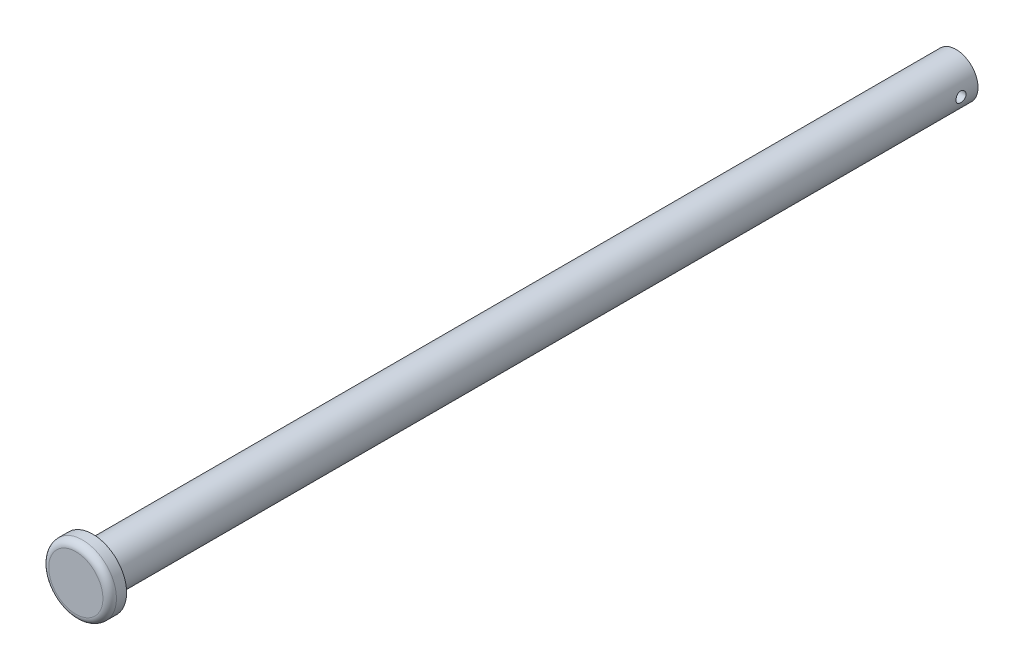
ISO-10303-21;
HEADER;
FILE_DESCRIPTION(('STEP AP214'),'2;1');
FILE_NAME('part.step','',(''),(''),'','','');
FILE_SCHEMA(('AUTOMOTIVE_DESIGN { 1 0 10303 214 1 1 1 1 }'));
ENDSEC;
DATA;
#1=APPLICATION_CONTEXT('core data for automotive mechanical design processes');
#2=APPLICATION_PROTOCOL_DEFINITION('international standard','automotive_design',2000,#1);
#3=PRODUCT_CONTEXT('',#1,'mechanical');
#4=PRODUCT('Part','Part','',(#3));
#5=PRODUCT_RELATED_PRODUCT_CATEGORY('part','',(#4));
#6=PRODUCT_DEFINITION_FORMATION('','',#4);
#7=PRODUCT_DEFINITION_CONTEXT('part definition',#1,'design');
#8=PRODUCT_DEFINITION('design','',#6,#7);
#9=PRODUCT_DEFINITION_SHAPE('','',#8);
#10=(LENGTH_UNIT() NAMED_UNIT(*) SI_UNIT(.MILLI.,.METRE.));
#11=(NAMED_UNIT(*) PLANE_ANGLE_UNIT() SI_UNIT($,.RADIAN.));
#12=(NAMED_UNIT(*) SI_UNIT($,.STERADIAN.) SOLID_ANGLE_UNIT());
#13=UNCERTAINTY_MEASURE_WITH_UNIT(LENGTH_MEASURE(1.E-05),#10,'distance_accuracy_value','');
#14=(GEOMETRIC_REPRESENTATION_CONTEXT(3) GLOBAL_UNCERTAINTY_ASSIGNED_CONTEXT((#13)) GLOBAL_UNIT_ASSIGNED_CONTEXT((#10,
#11,#12)) REPRESENTATION_CONTEXT('',''));
#15=CARTESIAN_POINT('',(0.,0.,0.));
#16=DIRECTION('',(0.,0.,1.));
#17=DIRECTION('',(1.,0.,0.));
#18=AXIS2_PLACEMENT_3D('',#15,#16,#17);
#19=CARTESIAN_POINT('',(0.,0.,255.));
#20=DIRECTION('',(0.,0.,-1.));
#21=DIRECTION('',(-1.,0.,0.));
#22=AXIS2_PLACEMENT_3D('',#19,#20,#21);
#23=CYLINDRICAL_SURFACE('',#22,6.5);
#24=CARTESIAN_POINT('',(-6.5,0.,6.50000000000001));
#25=CARTESIAN_POINT('',(-6.49999849532867,-0.0830761724763329,6.49999733464412));
#26=CARTESIAN_POINT('',(-6.49839124214547,-0.166183602986824,6.49307507318891));
#27=CARTESIAN_POINT('',(-6.49213500375529,-0.330029933246622,6.46560235711436));
#28=CARTESIAN_POINT('',(-6.48748401185165,-0.410767233683357,6.44504291155861));
#29=CARTESIAN_POINT('',(-6.4756571064677,-0.56748240064943,6.39098030105908));
#30=CARTESIAN_POINT('',(-6.46848397910972,-0.643465410431946,6.35749141486866));
#31=CARTESIAN_POINT('',(-6.45238316831829,-0.788732955280496,6.27856773493165));
#32=CARTESIAN_POINT('',(-6.44345549077589,-0.858017512835941,6.23313298129409));
#33=CARTESIAN_POINT('',(-6.42464323305021,-0.989152353123209,6.13075474832278));
#34=CARTESIAN_POINT('',(-6.41474568654138,-1.0508667921612,6.07363963829751));
#35=CARTESIAN_POINT('',(-6.39519859507266,-1.16393060397694,5.94989007342869));
#36=CARTESIAN_POINT('',(-6.38554907436474,-1.2152789664991,5.88325469183955));
#37=CARTESIAN_POINT('',(-6.36746174180576,-1.3067669575256,5.74133307243969));
#38=CARTESIAN_POINT('',(-6.35904049089481,-1.34675925477788,5.66594955902319));
#39=CARTESIAN_POINT('',(-6.34455046029963,-1.41345395330061,5.50930490134943));
#40=CARTESIAN_POINT('',(-6.33848136485541,-1.44015813854149,5.42804454775489));
#41=CARTESIAN_POINT('',(-6.32951534623235,-1.4790642425856,5.2634341984173));
#42=CARTESIAN_POINT('',(-6.32656557105072,-1.4915080949688,5.18014432662519));
#43=CARTESIAN_POINT('',(-6.32401364937952,-1.50229307046533,5.01261091295435));
#44=CARTESIAN_POINT('',(-6.32441104286172,-1.50063613156308,4.92836750371723));
#45=CARTESIAN_POINT('',(-6.32846083321138,-1.48346063285703,4.76313719217618));
#46=CARTESIAN_POINT('',(-6.33204661249556,-1.46822575315178,4.68211891865604));
#47=CARTESIAN_POINT('',(-6.34196351386389,-1.42477741479347,4.52382020809836));
#48=CARTESIAN_POINT('',(-6.34829480548987,-1.39656315462671,4.4465400022229));
#49=CARTESIAN_POINT('',(-6.36305332227188,-1.32770349075046,4.29712732835905));
#50=CARTESIAN_POINT('',(-6.37149843240945,-1.28695129246527,4.22504591908902));
#51=CARTESIAN_POINT('',(-6.38952239681953,-1.19424748975255,4.08864076371063));
#52=CARTESIAN_POINT('',(-6.39910142196225,-1.1422941964553,4.02431818974098));
#53=CARTESIAN_POINT('',(-6.41859777640792,-1.02717321086452,3.90362604994904));
#54=CARTESIAN_POINT('',(-6.42851768847713,-0.963764950845046,3.84748611487504));
#55=CARTESIAN_POINT('',(-6.44736816069401,-0.8283186410534,3.74659692902463));
#56=CARTESIAN_POINT('',(-6.45629869876004,-0.75628039874503,3.70184793245139));
#57=CARTESIAN_POINT('',(-6.47219854082993,-0.60532127797237,3.62494408585666));
#58=CARTESIAN_POINT('',(-6.47916273202417,-0.526383143294241,3.59282198430733));
#59=CARTESIAN_POINT('',(-6.49030757986402,-0.364032396252573,3.54236385630495));
#60=CARTESIAN_POINT('',(-6.49448868821629,-0.280620512374232,3.52402559261152));
#61=CARTESIAN_POINT('',(-6.49953102945198,-0.113657323931638,3.50199584965185));
#62=CARTESIAN_POINT('',(-6.50046326526885,-0.0301494450127247,3.49799106394026));
#63=CARTESIAN_POINT('',(-6.49910299913129,0.136342371579228,3.50388901475929));
#64=CARTESIAN_POINT('',(-6.49681074208306,0.219326348562747,3.51379069506801));
#65=CARTESIAN_POINT('',(-6.48930412349636,0.381357903798026,3.54696119660578));
#66=CARTESIAN_POINT('',(-6.48412623941868,0.460441464875706,3.57006324131715));
#67=CARTESIAN_POINT('',(-6.47142910428788,0.613609622481669,3.62879158892438));
#68=CARTESIAN_POINT('',(-6.46390963894221,0.687693760726586,3.66441903813586));
#69=CARTESIAN_POINT('',(-6.44718996088191,0.830037615110187,3.747822643921));
#70=CARTESIAN_POINT('',(-6.43796535296184,0.898188410296332,3.79577969188521));
#71=CARTESIAN_POINT('',(-6.41890391913981,1.02558718048179,3.90224561735857));
#72=CARTESIAN_POINT('',(-6.40906700421673,1.08483385664763,3.96075603154158));
#73=CARTESIAN_POINT('',(-6.38964047483402,1.19400102833017,4.08811238587905));
#74=CARTESIAN_POINT('',(-6.3800601750374,1.24370343589041,4.15714696467741));
#75=CARTESIAN_POINT('',(-6.36246188496285,1.3308123544641,4.30276588021528));
#76=CARTESIAN_POINT('',(-6.35444382521927,1.36821941224621,4.37934988103844));
#77=CARTESIAN_POINT('',(-6.34095951164845,1.4294106686813,4.53747598842251));
#78=CARTESIAN_POINT('',(-6.33547846174879,1.45327404481082,4.61898612968342));
#79=CARTESIAN_POINT('',(-6.3276660054956,1.48692530676326,4.78500399284776));
#80=CARTESIAN_POINT('',(-6.32533402889436,1.49671574099563,4.86951116919002));
#81=CARTESIAN_POINT('',(-6.32412253425542,1.50182536015786,5.03691822705261));
#82=CARTESIAN_POINT('',(-6.32516029248235,1.49749127871472,5.11980711064855));
#83=CARTESIAN_POINT('',(-6.33038270361014,1.47525685980881,5.28363867866817));
#84=CARTESIAN_POINT('',(-6.33456731037361,1.45735672124419,5.36458139160759));
#85=CARTESIAN_POINT('',(-6.34556939165105,1.40867420720144,5.52190991079111));
#86=CARTESIAN_POINT('',(-6.35237543592818,1.37794771033573,5.59831386070584));
#87=CARTESIAN_POINT('',(-6.36785683112448,1.30453082227101,5.74493180654131));
#88=CARTESIAN_POINT('',(-6.37653240158127,1.26183902581515,5.81514507412733));
#89=CARTESIAN_POINT('',(-6.39501829374306,1.16457679516264,5.94908552859006));
#90=CARTESIAN_POINT('',(-6.4048496868242,1.10976162033289,6.01263211954957));
#91=CARTESIAN_POINT('',(-6.42440402438128,0.990297714593223,6.12973824763829));
#92=CARTESIAN_POINT('',(-6.43412694306169,0.925646696024383,6.18329545493027));
#93=CARTESIAN_POINT('',(-6.45253999299533,0.78719193276155,6.2796672679488));
#94=CARTESIAN_POINT('',(-6.46121270567525,0.713266869084885,6.32231111828977));
#95=CARTESIAN_POINT('',(-6.47637045552876,0.55910964147537,6.39449914940862));
#96=CARTESIAN_POINT('',(-6.48285722936411,0.478882547101938,6.42405373510296));
#97=CARTESIAN_POINT('',(-6.49182723396726,0.33221037419877,6.46427847355576));
#98=CARTESIAN_POINT('',(-6.49487228966801,0.266526367321009,6.47764727102701));
#99=CARTESIAN_POINT('',(-6.4989592245111,0.133901630280834,6.49550886661472));
#100=CARTESIAN_POINT('',(-6.5000012127936,0.0669609687898303,6.50000214832734));
#101=CARTESIAN_POINT('',(-6.5,0.,6.50000000000001));
#102=B_SPLINE_CURVE_WITH_KNOTS('',3,(#24,#25,#26,#27,#28,#29,#30,#31,#32,#33,#34,#35,#36,#37,
#38,#39,#40,#41,#42,#43,#44,#45,#46,#47,#48,#49,#50,#51,#52,#53,#54,#55,#56,#57,#58,#59,#60,#61,
#62,#63,#64,#65,#66,#67,#68,#69,#70,#71,#72,#73,#74,#75,#76,#77,#78,#79,#80,#81,#82,#83,#84,#85,
#86,#87,#88,#89,#90,#91,#92,#93,#94,#95,#96,#97,#98,#99,#100,#101),.UNSPECIFIED.,.T.,.F.,(4,2,2,
2,2,2,2,2,2,2,2,2,2,2,2,2,2,2,2,2,2,2,2,2,2,2,2,2,2,2,2,2,2,2,2,2,2,2,4),(0.,0.248983311217111,
0.498130939431091,0.747004202472737,0.995876629917191,1.2487093022222,1.50156660317463,
1.75756840109411,2.01353582069622,2.26509316141459,2.51661592915606,2.76300377758331,
3.00940684320487,3.25796969712267,3.50657005489342,3.76117526279512,4.01578615203545,
4.27105309773004,4.52627860236007,4.77589001432917,5.02548246887373,5.27198911757479,
5.51851833225483,5.76889433751054,6.01930682944869,6.27489540554878,6.5304726142016,
6.78453988631539,7.03856114466416,7.28639401438665,7.53422325058915,7.78098389306529,
8.027773528338,8.28009323709706,8.53247172133002,8.78858609727297,9.04449651578222,
9.24519271684377,9.44587798236135),.UNSPECIFIED.);
#103=CARTESIAN_POINT('',(-6.5,0.,6.50000000000001));
#104=VERTEX_POINT('',#103);
#105=EDGE_CURVE('E47',#104,#104,#102,.T.);
#106=ORIENTED_EDGE('',*,*,#105,.T.);
#107=EDGE_LOOP('',(#106));
#108=FACE_BOUND('',#107,.T.);
#109=CARTESIAN_POINT('',(6.5,0.,3.5));
#110=CARTESIAN_POINT('',(6.49999849532867,-0.0830761724763339,3.50000266535589));
#111=CARTESIAN_POINT('',(6.49839124214546,-0.166183602986826,3.5069249268111));
#112=CARTESIAN_POINT('',(6.49213500375529,-0.330029933246627,3.53439764288565));
#113=CARTESIAN_POINT('',(6.48748401185166,-0.410767233683363,3.5549570884414));
#114=CARTESIAN_POINT('',(6.47565710646771,-0.567482400649435,3.60901969894093));
#115=CARTESIAN_POINT('',(6.46848397910972,-0.64346541043195,3.64250858513135));
#116=CARTESIAN_POINT('',(6.45238316831829,-0.788732955280497,3.72143226506836));
#117=CARTESIAN_POINT('',(6.44345549077589,-0.858017512835942,3.76686701870592));
#118=CARTESIAN_POINT('',(6.42464323305021,-0.98915235312321,3.86924525167722));
#119=CARTESIAN_POINT('',(6.41474568654138,-1.0508667921612,3.9263603617025));
#120=CARTESIAN_POINT('',(6.39519859507266,-1.16393060397694,4.05010992657132));
#121=CARTESIAN_POINT('',(6.38554907436474,-1.2152789664991,4.11674530816046));
#122=CARTESIAN_POINT('',(6.36746174180576,-1.3067669575256,4.25866692756032));
#123=CARTESIAN_POINT('',(6.35904049089481,-1.34675925477788,4.33405044097682));
#124=CARTESIAN_POINT('',(6.34455046029963,-1.41345395330061,4.49069509865057));
#125=CARTESIAN_POINT('',(6.33848136485541,-1.44015813854148,4.57195545224511));
#126=CARTESIAN_POINT('',(6.32951534623235,-1.4790642425856,4.7365658015827));
#127=CARTESIAN_POINT('',(6.32656557105072,-1.49150809496879,4.8198556733748));
#128=CARTESIAN_POINT('',(6.32401364937952,-1.50229307046533,4.98738908704563));
#129=CARTESIAN_POINT('',(6.32441104286174,-1.50063613156308,5.07163249628273));
#130=CARTESIAN_POINT('',(6.32846083321139,-1.48346063285704,5.23686280782378));
#131=CARTESIAN_POINT('',(6.33204661249555,-1.46822575315179,5.31788108134392));
#132=CARTESIAN_POINT('',(6.34196351386388,-1.42477741479348,5.4761797919016));
#133=CARTESIAN_POINT('',(6.34829480548987,-1.3965631546267,5.55345999777705));
#134=CARTESIAN_POINT('',(6.36305332227188,-1.32770349075045,5.70287267164091));
#135=CARTESIAN_POINT('',(6.37149843240945,-1.28695129246528,5.77495408091097));
#136=CARTESIAN_POINT('',(6.38952239681953,-1.19424748975257,5.91135923628938));
#137=CARTESIAN_POINT('',(6.39910142196225,-1.14229419645531,5.97568181025902));
#138=CARTESIAN_POINT('',(6.41859777640792,-1.02717321086453,6.09637395005097));
#139=CARTESIAN_POINT('',(6.42851768847712,-0.963764950845063,6.15251388512497));
#140=CARTESIAN_POINT('',(6.44736816069401,-0.828318641053416,6.25340307097535));
#141=CARTESIAN_POINT('',(6.45629869876005,-0.756280398745034,6.29815206754856));
#142=CARTESIAN_POINT('',(6.47219854082994,-0.605321277972371,6.3750559141433));
#143=CARTESIAN_POINT('',(6.47916273202417,-0.526383143294251,6.40717801569266));
#144=CARTESIAN_POINT('',(6.49030757986402,-0.364032396252584,6.45763614369506));
#145=CARTESIAN_POINT('',(6.4944886882163,-0.280620512374237,6.47597440738849));
#146=CARTESIAN_POINT('',(6.49953102945198,-0.113657323931637,6.49800415034816));
#147=CARTESIAN_POINT('',(6.50046326526885,-0.0301494450127262,6.50200893605974));
#148=CARTESIAN_POINT('',(6.49910299913129,0.136342371579226,6.49611098524072));
#149=CARTESIAN_POINT('',(6.49681074208307,0.219326348562746,6.48620930493199));
#150=CARTESIAN_POINT('',(6.48930412349637,0.381357903798028,6.45303880339423));
#151=CARTESIAN_POINT('',(6.48412623941868,0.460441464875709,6.42993675868286));
#152=CARTESIAN_POINT('',(6.47142910428788,0.613609622481674,6.37120841107563));
#153=CARTESIAN_POINT('',(6.46390963894221,0.687693760726593,6.33558096186415));
#154=CARTESIAN_POINT('',(6.44718996088191,0.830037615110193,6.25217735607901));
#155=CARTESIAN_POINT('',(6.43796535296184,0.898188410296335,6.2042203081148));
#156=CARTESIAN_POINT('',(6.41890391913982,1.02558718048179,6.09775438264144));
#157=CARTESIAN_POINT('',(6.40906700421674,1.08483385664763,6.03924396845843));
#158=CARTESIAN_POINT('',(6.38964047483402,1.19400102833017,5.91188761412096));
#159=CARTESIAN_POINT('',(6.3800601750374,1.24370343589042,5.8428530353226));
#160=CARTESIAN_POINT('',(6.36246188496285,1.3308123544641,5.69723411978473));
#161=CARTESIAN_POINT('',(6.35444382521927,1.3682194122462,5.62065011896157));
#162=CARTESIAN_POINT('',(6.34095951164845,1.4294106686813,5.4625240115775));
#163=CARTESIAN_POINT('',(6.33547846174879,1.45327404481082,5.38101387031659));
#164=CARTESIAN_POINT('',(6.3276660054956,1.48692530676326,5.21499600715225));
#165=CARTESIAN_POINT('',(6.32533402889436,1.49671574099563,5.13048883080999));
#166=CARTESIAN_POINT('',(6.32412253425542,1.50182536015786,4.96308177294739));
#167=CARTESIAN_POINT('',(6.32516029248235,1.49749127871472,4.88019288935146));
#168=CARTESIAN_POINT('',(6.33038270361014,1.47525685980881,4.71636132133184));
#169=CARTESIAN_POINT('',(6.33456731037362,1.45735672124418,4.63541860839242));
#170=CARTESIAN_POINT('',(6.34556939165105,1.40867420720144,4.4780900892089));
#171=CARTESIAN_POINT('',(6.35237543592818,1.37794771033573,4.40168613929417));
#172=CARTESIAN_POINT('',(6.36785683112448,1.30453082227101,4.25506819345869));
#173=CARTESIAN_POINT('',(6.37653240158128,1.26183902581514,4.18485492587268));
#174=CARTESIAN_POINT('',(6.39501829374307,1.16457679516263,4.05091447140995));
#175=CARTESIAN_POINT('',(6.4048496868242,1.10976162033288,3.98736788045044));
#176=CARTESIAN_POINT('',(6.42440402438128,0.990297714593223,3.87026175236172));
#177=CARTESIAN_POINT('',(6.43412694306169,0.925646696024383,3.81670454506974));
#178=CARTESIAN_POINT('',(6.45253999299534,0.78719193276155,3.72033273205121));
#179=CARTESIAN_POINT('',(6.46121270567525,0.713266869084884,3.67768888171024));
#180=CARTESIAN_POINT('',(6.47637045552876,0.559109641475369,3.60550085059138));
#181=CARTESIAN_POINT('',(6.48285722936411,0.478882547101938,3.57594626489705));
#182=CARTESIAN_POINT('',(6.49182723396727,0.33221037419877,3.53572152644425));
#183=CARTESIAN_POINT('',(6.49487228966801,0.266526367321009,3.522352728973));
#184=CARTESIAN_POINT('',(6.4989592245111,0.133901630280834,3.50449113338529));
#185=CARTESIAN_POINT('',(6.5000012127936,0.0669609687898303,3.49999785167266));
#186=CARTESIAN_POINT('',(6.5,0.,3.5));
#187=B_SPLINE_CURVE_WITH_KNOTS('',3,(#109,#110,#111,#112,#113,#114,#115,#116,#117,#118,#119,
#120,#121,#122,#123,#124,#125,#126,#127,#128,#129,#130,#131,#132,#133,#134,#135,#136,#137,#138,
#139,#140,#141,#142,#143,#144,#145,#146,#147,#148,#149,#150,#151,#152,#153,#154,#155,#156,#157,
#158,#159,#160,#161,#162,#163,#164,#165,#166,#167,#168,#169,#170,#171,#172,#173,#174,#175,#176,
#177,#178,#179,#180,#181,#182,#183,#184,#185,#186),.UNSPECIFIED.,.T.,.F.,(4,2,2,2,2,2,2,2,2,2,2,
2,2,2,2,2,2,2,2,2,2,2,2,2,2,2,2,2,2,2,2,2,2,2,2,2,2,2,4),(0.,0.248983311217114,
0.498130939431097,0.747004202472741,0.995876629917192,1.24870930222221,1.50156660317463,
1.75756840109411,2.01353582069622,2.26509316141456,2.516615929156,2.76300377758325,
3.00940684320482,3.25796969712264,3.50657005489342,3.76117526279509,4.01578615203541,
4.27105309773002,4.52627860236006,4.77589001432916,5.02548246887371,5.27198911757478,
5.51851833225482,5.76889433751052,6.01930682944868,6.27489540554877,6.53047261420159,
6.78453988631538,7.03856114466415,7.28639401438664,7.53422325058915,7.78098389306528,
8.02777352833799,8.28009323709705,8.53247172133001,8.78858609727296,9.04449651578221,
9.24519271684375,9.44587798236134),.UNSPECIFIED.);
#188=CARTESIAN_POINT('',(6.5,0.,3.5));
#189=VERTEX_POINT('',#188);
#190=EDGE_CURVE('E67',#189,#189,#187,.T.);
#191=ORIENTED_EDGE('',*,*,#190,.T.);
#192=EDGE_LOOP('',(#191));
#193=FACE_BOUND('',#192,.T.);
#194=CARTESIAN_POINT('',(0.,0.,253.));
#195=DIRECTION('',(0.,0.,1.));
#196=DIRECTION('',(1.,0.,0.));
#197=AXIS2_PLACEMENT_3D('',#194,#195,#196);
#198=CIRCLE('',#197,6.5);
#199=CARTESIAN_POINT('',(6.5,0.,253.));
#200=VERTEX_POINT('',#199);
#201=EDGE_CURVE('E10',#200,#200,#198,.F.);
#202=ORIENTED_EDGE('',*,*,#201,.T.);
#203=EDGE_LOOP('',(#202));
#204=FACE_BOUND('',#203,.T.);
#205=CARTESIAN_POINT('',(0.,0.,0.));
#206=DIRECTION('',(0.,0.,1.));
#207=DIRECTION('',(1.,0.,0.));
#208=AXIS2_PLACEMENT_3D('',#205,#206,#207);
#209=CIRCLE('',#208,6.5);
#210=CARTESIAN_POINT('',(6.5,0.,0.));
#211=VERTEX_POINT('',#210);
#212=EDGE_CURVE('E102',#211,#211,#209,.T.);
#213=ORIENTED_EDGE('',*,*,#212,.T.);
#214=EDGE_LOOP('',(#213));
#215=FACE_BOUND('',#214,.T.);
#216=ADVANCED_FACE('F43',(#108,#193,#204,#215),#23,.T.);
#217=CARTESIAN_POINT('',(0.,0.,0.));
#218=DIRECTION('',(0.,0.,1.));
#219=DIRECTION('',(1.,0.,0.));
#220=AXIS2_PLACEMENT_3D('',#217,#218,#219);
#221=PLANE('',#220);
#222=ORIENTED_EDGE('',*,*,#212,.F.);
#223=EDGE_LOOP('',(#222));
#224=FACE_BOUND('',#223,.T.);
#225=ADVANCED_FACE('F92',(#224),#221,.F.);
#226=CARTESIAN_POINT('',(0.,0.,260.));
#227=DIRECTION('',(0.,0.,-1.));
#228=DIRECTION('',(-1.,0.,0.));
#229=AXIS2_PLACEMENT_3D('',#226,#227,#228);
#230=CYLINDRICAL_SURFACE('',#229,10.);
#231=CARTESIAN_POINT('',(0.,0.,258.));
#232=DIRECTION('',(0.,0.,1.));
#233=DIRECTION('',(1.,0.,0.));
#234=AXIS2_PLACEMENT_3D('',#231,#232,#233);
#235=CIRCLE('',#234,10.);
#236=CARTESIAN_POINT('',(10.,0.,258.));
#237=VERTEX_POINT('',#236);
#238=EDGE_CURVE('E64',#237,#237,#235,.F.);
#239=ORIENTED_EDGE('',*,*,#238,.T.);
#240=EDGE_LOOP('',(#239));
#241=FACE_BOUND('',#240,.T.);
#242=CARTESIAN_POINT('',(0.,0.,255.));
#243=DIRECTION('',(0.,0.,1.));
#244=DIRECTION('',(1.,0.,0.));
#245=AXIS2_PLACEMENT_3D('',#242,#243,#244);
#246=CIRCLE('',#245,10.);
#247=CARTESIAN_POINT('',(10.,0.,255.));
#248=VERTEX_POINT('',#247);
#249=EDGE_CURVE('E106',#248,#248,#246,.T.);
#250=ORIENTED_EDGE('',*,*,#249,.T.);
#251=EDGE_LOOP('',(#250));
#252=FACE_BOUND('',#251,.T.);
#253=ADVANCED_FACE('F85',(#241,#252),#230,.T.);
#254=CARTESIAN_POINT('',(0.,0.,260.));
#255=DIRECTION('',(0.,0.,1.));
#256=DIRECTION('',(1.,0.,0.));
#257=AXIS2_PLACEMENT_3D('',#254,#255,#256);
#258=PLANE('',#257);
#259=CARTESIAN_POINT('',(0.,0.,260.));
#260=DIRECTION('',(0.,0.,1.));
#261=DIRECTION('',(1.,0.,0.));
#262=AXIS2_PLACEMENT_3D('',#259,#260,#261);
#263=CIRCLE('',#262,8.);
#264=CARTESIAN_POINT('',(8.,0.,260.));
#265=VERTEX_POINT('',#264);
#266=EDGE_CURVE('E105',#265,#265,#263,.T.);
#267=ORIENTED_EDGE('',*,*,#266,.T.);
#268=EDGE_LOOP('',(#267));
#269=FACE_BOUND('',#268,.T.);
#270=ADVANCED_FACE('F80',(#269),#258,.T.);
#271=CARTESIAN_POINT('',(0.,0.,255.));
#272=DIRECTION('',(0.,0.,1.));
#273=DIRECTION('',(1.,0.,0.));
#274=AXIS2_PLACEMENT_3D('',#271,#272,#273);
#275=PLANE('',#274);
#276=CARTESIAN_POINT('',(0.,0.,255.));
#277=DIRECTION('',(0.,0.,1.));
#278=DIRECTION('',(1.,0.,0.));
#279=AXIS2_PLACEMENT_3D('',#276,#277,#278);
#280=CIRCLE('',#279,8.5);
#281=CARTESIAN_POINT('',(8.5,0.,255.));
#282=VERTEX_POINT('',#281);
#283=EDGE_CURVE('E57',#282,#282,#280,.T.);
#284=ORIENTED_EDGE('',*,*,#283,.T.);
#285=EDGE_LOOP('',(#284));
#286=FACE_BOUND('',#285,.T.);
#287=ORIENTED_EDGE('',*,*,#249,.F.);
#288=EDGE_LOOP('',(#287));
#289=FACE_BOUND('',#288,.T.);
#290=ADVANCED_FACE('F84',(#286,#289),#275,.F.);
#291=CARTESIAN_POINT('',(0.,0.,258.));
#292=DIRECTION('',(0.,0.,1.));
#293=DIRECTION('',(1.,0.,0.));
#294=AXIS2_PLACEMENT_3D('',#291,#292,#293);
#295=TOROIDAL_SURFACE('',#294,8.,2.);
#296=ORIENTED_EDGE('',*,*,#238,.F.);
#297=EDGE_LOOP('',(#296));
#298=FACE_BOUND('',#297,.T.);
#299=ORIENTED_EDGE('',*,*,#266,.F.);
#300=EDGE_LOOP('',(#299));
#301=FACE_BOUND('',#300,.T.);
#302=ADVANCED_FACE('F89',(#298,#301),#295,.T.);
#303=CARTESIAN_POINT('',(0.,0.,253.));
#304=DIRECTION('',(0.,0.,1.));
#305=DIRECTION('',(1.,0.,0.));
#306=AXIS2_PLACEMENT_3D('',#303,#304,#305);
#307=TOROIDAL_SURFACE('',#306,8.5,2.);
#308=ORIENTED_EDGE('',*,*,#201,.F.);
#309=EDGE_LOOP('',(#308));
#310=FACE_BOUND('',#309,.T.);
#311=ORIENTED_EDGE('',*,*,#283,.F.);
#312=EDGE_LOOP('',(#311));
#313=FACE_BOUND('',#312,.T.);
#314=ADVANCED_FACE('F45',(#310,#313),#307,.F.);
#315=CARTESIAN_POINT('',(-10.,0.,5.));
#316=DIRECTION('',(1.,0.,0.));
#317=DIRECTION('',(0.,0.,-1.));
#318=AXIS2_PLACEMENT_3D('',#315,#316,#317);
#319=CYLINDRICAL_SURFACE('',#318,1.5);
#320=ORIENTED_EDGE('',*,*,#190,.F.);
#321=EDGE_LOOP('',(#320));
#322=FACE_BOUND('',#321,.T.);
#323=ORIENTED_EDGE('',*,*,#105,.F.);
#324=EDGE_LOOP('',(#323));
#325=FACE_BOUND('',#324,.T.);
#326=ADVANCED_FACE('F75',(#322,#325),#319,.F.);
#327=CLOSED_SHELL('',(#216,#225,#253,#270,#290,#302,#314,#326));
#328=MANIFOLD_SOLID_BREP('B2',#327);
#329=ADVANCED_BREP_SHAPE_REPRESENTATION('',(#18,#328),#14);
#330=SHAPE_DEFINITION_REPRESENTATION(#9,#329);
ENDSEC;
END-ISO-10303-21;
